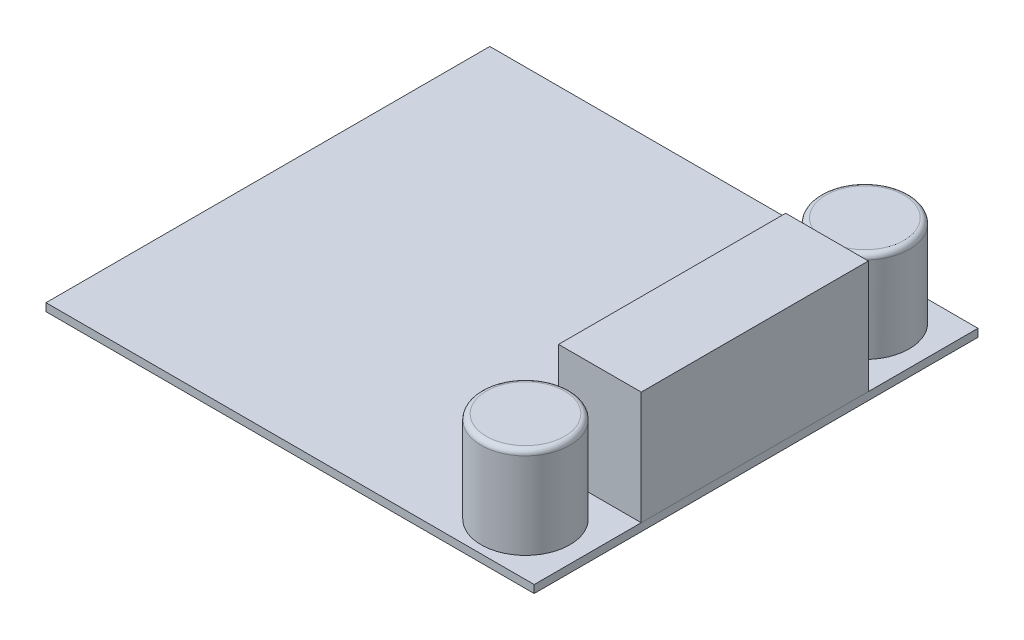
ISO-10303-21;
HEADER;
FILE_DESCRIPTION(('STEP AP214'),'2;1');
FILE_NAME('part.step','',(''),(''),'','','');
FILE_SCHEMA(('AUTOMOTIVE_DESIGN { 1 0 10303 214 1 1 1 1 }'));
ENDSEC;
DATA;
#1=APPLICATION_CONTEXT('core data for automotive mechanical design processes');
#2=APPLICATION_PROTOCOL_DEFINITION('international standard','automotive_design',2000,#1);
#3=PRODUCT_CONTEXT('',#1,'mechanical');
#4=PRODUCT('Part','Part','',(#3));
#5=PRODUCT_RELATED_PRODUCT_CATEGORY('part','',(#4));
#6=PRODUCT_DEFINITION_FORMATION('','',#4);
#7=PRODUCT_DEFINITION_CONTEXT('part definition',#1,'design');
#8=PRODUCT_DEFINITION('design','',#6,#7);
#9=PRODUCT_DEFINITION_SHAPE('','',#8);
#10=(LENGTH_UNIT() NAMED_UNIT(*) SI_UNIT(.MILLI.,.METRE.));
#11=(NAMED_UNIT(*) PLANE_ANGLE_UNIT() SI_UNIT($,.RADIAN.));
#12=(NAMED_UNIT(*) SI_UNIT($,.STERADIAN.) SOLID_ANGLE_UNIT());
#13=UNCERTAINTY_MEASURE_WITH_UNIT(LENGTH_MEASURE(1.E-05),#10,'distance_accuracy_value','');
#14=(GEOMETRIC_REPRESENTATION_CONTEXT(3) GLOBAL_UNCERTAINTY_ASSIGNED_CONTEXT((#13)) GLOBAL_UNIT_ASSIGNED_CONTEXT((#10,
#11,#12)) REPRESENTATION_CONTEXT('',''));
#15=CARTESIAN_POINT('',(0.,0.,0.));
#16=DIRECTION('',(0.,0.,1.));
#17=DIRECTION('',(1.,0.,0.));
#18=AXIS2_PLACEMENT_3D('',#15,#16,#17);
#19=CARTESIAN_POINT('',(18.55,13.9,-12.9));
#20=DIRECTION('',(1.,0.,0.));
#21=DIRECTION('',(0.,0.,-1.));
#22=AXIS2_PLACEMENT_3D('',#19,#20,#21);
#23=PLANE('',#22);
#24=DIRECTION('',(0.,0.,1.));
#25=VECTOR('',#24,1.);
#26=CARTESIAN_POINT('',(18.55,0.9,-12.9));
#27=LINE('',#26,#25);
#28=CARTESIAN_POINT('',(18.55,0.9,-12.9));
#29=VERTEX_POINT('',#28);
#30=CARTESIAN_POINT('',(18.55,0.9,13.2));
#31=VERTEX_POINT('',#30);
#32=EDGE_CURVE('E105',#29,#31,#27,.T.);
#33=ORIENTED_EDGE('',*,*,#32,.T.);
#34=DIRECTION('',(0.,-1.,0.));
#35=VECTOR('',#34,1.);
#36=CARTESIAN_POINT('',(18.55,13.9,13.2));
#37=LINE('',#36,#35);
#38=CARTESIAN_POINT('',(18.55,13.9,13.2));
#39=VERTEX_POINT('',#38);
#40=EDGE_CURVE('E12',#39,#31,#37,.T.);
#41=ORIENTED_EDGE('',*,*,#40,.F.);
#42=DIRECTION('',(0.,0.,1.));
#43=VECTOR('',#42,1.);
#44=CARTESIAN_POINT('',(18.55,13.9,-12.9));
#45=LINE('',#44,#43);
#46=CARTESIAN_POINT('',(18.55,13.9,-12.9));
#47=VERTEX_POINT('',#46);
#48=EDGE_CURVE('E93',#47,#39,#45,.T.);
#49=ORIENTED_EDGE('',*,*,#48,.F.);
#50=DIRECTION('',(0.,-1.,0.));
#51=VECTOR('',#50,1.);
#52=CARTESIAN_POINT('',(18.55,13.9,-12.9));
#53=LINE('',#52,#51);
#54=EDGE_CURVE('E101',#47,#29,#53,.T.);
#55=ORIENTED_EDGE('',*,*,#54,.T.);
#56=EDGE_LOOP('',(#33,#41,#49,#55));
#57=FACE_BOUND('',#56,.T.);
#58=ADVANCED_FACE('F42',(#57),#23,.F.);
#59=CARTESIAN_POINT('',(18.55,13.9,13.2));
#60=DIRECTION('',(0.,0.,-1.));
#61=DIRECTION('',(-1.,0.,0.));
#62=AXIS2_PLACEMENT_3D('',#59,#60,#61);
#63=PLANE('',#62);
#64=DIRECTION('',(1.,0.,0.));
#65=VECTOR('',#64,1.);
#66=CARTESIAN_POINT('',(18.55,0.9,13.2));
#67=LINE('',#66,#65);
#68=CARTESIAN_POINT('',(28.05,0.9,13.2));
#69=VERTEX_POINT('',#68);
#70=EDGE_CURVE('E97',#31,#69,#67,.T.);
#71=ORIENTED_EDGE('',*,*,#70,.T.);
#72=DIRECTION('',(0.,-1.,0.));
#73=VECTOR('',#72,1.);
#74=CARTESIAN_POINT('',(28.05,13.9,13.2));
#75=LINE('',#74,#73);
#76=CARTESIAN_POINT('',(28.05,13.9,13.2));
#77=VERTEX_POINT('',#76);
#78=EDGE_CURVE('E50',#77,#69,#75,.T.);
#79=ORIENTED_EDGE('',*,*,#78,.F.);
#80=DIRECTION('',(1.,0.,0.));
#81=VECTOR('',#80,1.);
#82=CARTESIAN_POINT('',(18.55,13.9,13.2));
#83=LINE('',#82,#81);
#84=EDGE_CURVE('E88',#39,#77,#83,.T.);
#85=ORIENTED_EDGE('',*,*,#84,.F.);
#86=ORIENTED_EDGE('',*,*,#40,.T.);
#87=EDGE_LOOP('',(#71,#79,#85,#86));
#88=FACE_BOUND('',#87,.T.);
#89=ADVANCED_FACE('F96',(#88),#63,.F.);
#90=CARTESIAN_POINT('',(28.05,13.9,-12.9));
#91=DIRECTION('',(-1.,0.,0.));
#92=DIRECTION('',(0.,0.,1.));
#93=AXIS2_PLACEMENT_3D('',#90,#91,#92);
#94=PLANE('',#93);
#95=DIRECTION('',(0.,0.,-1.));
#96=VECTOR('',#95,1.);
#97=CARTESIAN_POINT('',(28.05,0.9,-12.9));
#98=LINE('',#97,#96);
#99=CARTESIAN_POINT('',(28.05,0.9,-12.9));
#100=VERTEX_POINT('',#99);
#101=EDGE_CURVE('E75',#69,#100,#98,.T.);
#102=ORIENTED_EDGE('',*,*,#101,.T.);
#103=DIRECTION('',(0.,-1.,0.));
#104=VECTOR('',#103,1.);
#105=CARTESIAN_POINT('',(28.05,13.9,-12.9));
#106=LINE('',#105,#104);
#107=CARTESIAN_POINT('',(28.05,13.9,-12.9));
#108=VERTEX_POINT('',#107);
#109=EDGE_CURVE('E98',#108,#100,#106,.T.);
#110=ORIENTED_EDGE('',*,*,#109,.F.);
#111=DIRECTION('',(0.,0.,-1.));
#112=VECTOR('',#111,1.);
#113=CARTESIAN_POINT('',(28.05,13.9,-12.9));
#114=LINE('',#113,#112);
#115=EDGE_CURVE('E91',#77,#108,#114,.T.);
#116=ORIENTED_EDGE('',*,*,#115,.F.);
#117=ORIENTED_EDGE('',*,*,#78,.T.);
#118=EDGE_LOOP('',(#102,#110,#116,#117));
#119=FACE_BOUND('',#118,.T.);
#120=ADVANCED_FACE('F99',(#119),#94,.F.);
#121=CARTESIAN_POINT('',(18.55,13.9,-12.9));
#122=DIRECTION('',(0.,0.,1.));
#123=DIRECTION('',(1.,0.,0.));
#124=AXIS2_PLACEMENT_3D('',#121,#122,#123);
#125=PLANE('',#124);
#126=DIRECTION('',(-1.,0.,0.));
#127=VECTOR('',#126,1.);
#128=CARTESIAN_POINT('',(18.55,0.9,-12.9));
#129=LINE('',#128,#127);
#130=EDGE_CURVE('E81',#100,#29,#129,.T.);
#131=ORIENTED_EDGE('',*,*,#130,.T.);
#132=ORIENTED_EDGE('',*,*,#54,.F.);
#133=DIRECTION('',(-1.,0.,0.));
#134=VECTOR('',#133,1.);
#135=CARTESIAN_POINT('',(18.55,13.9,-12.9));
#136=LINE('',#135,#134);
#137=EDGE_CURVE('E58',#108,#47,#136,.T.);
#138=ORIENTED_EDGE('',*,*,#137,.F.);
#139=ORIENTED_EDGE('',*,*,#109,.T.);
#140=EDGE_LOOP('',(#131,#132,#138,#139));
#141=FACE_BOUND('',#140,.T.);
#142=ADVANCED_FACE('F112',(#141),#125,.F.);
#143=CARTESIAN_POINT('',(0.,13.9,0.));
#144=DIRECTION('',(0.,1.,0.));
#145=DIRECTION('',(0.,0.,1.));
#146=AXIS2_PLACEMENT_3D('',#143,#144,#145);
#147=PLANE('',#146);
#148=ORIENTED_EDGE('',*,*,#48,.T.);
#149=ORIENTED_EDGE('',*,*,#84,.T.);
#150=ORIENTED_EDGE('',*,*,#115,.T.);
#151=ORIENTED_EDGE('',*,*,#137,.T.);
#152=EDGE_LOOP('',(#148,#149,#150,#151));
#153=FACE_BOUND('',#152,.T.);
#154=ADVANCED_FACE('F89',(#153),#147,.T.);
#155=CARTESIAN_POINT('',(0.,0.9,0.));
#156=DIRECTION('',(0.,1.,0.));
#157=DIRECTION('',(0.,0.,1.));
#158=AXIS2_PLACEMENT_3D('',#155,#156,#157);
#159=PLANE('',#158);
#160=ORIENTED_EDGE('',*,*,#32,.F.);
#161=ORIENTED_EDGE('',*,*,#130,.F.);
#162=ORIENTED_EDGE('',*,*,#101,.F.);
#163=ORIENTED_EDGE('',*,*,#70,.F.);
#164=EDGE_LOOP('',(#160,#161,#162,#163));
#165=FACE_BOUND('',#164,.T.);
#166=ADVANCED_FACE('F115',(#165),#159,.F.);
#167=CLOSED_SHELL('',(#58,#89,#120,#142,#154,#166));
#168=MANIFOLD_SOLID_BREP('B2',#167);
#169=CARTESIAN_POINT('',(0.,0.9,0.));
#170=DIRECTION('',(0.,-1.,0.));
#171=DIRECTION('',(0.,0.,-1.));
#172=AXIS2_PLACEMENT_3D('',#169,#170,#171);
#173=PLANE('',#172);
#174=DIRECTION('',(0.,0.,-1.));
#175=VECTOR('',#174,1.);
#176=CARTESIAN_POINT('',(28.05,0.9,25.5));
#177=LINE('',#176,#175);
#178=CARTESIAN_POINT('',(28.05,0.9,25.5));
#179=VERTEX_POINT('',#178);
#180=CARTESIAN_POINT('',(28.05,0.9,-25.5));
#181=VERTEX_POINT('',#180);
#182=EDGE_CURVE('E218',#179,#181,#177,.T.);
#183=ORIENTED_EDGE('',*,*,#182,.T.);
#184=DIRECTION('',(-1.,0.,0.));
#185=VECTOR('',#184,1.);
#186=CARTESIAN_POINT('',(-28.05,0.9,-25.5));
#187=LINE('',#186,#185);
#188=CARTESIAN_POINT('',(-28.05,0.9,-25.5));
#189=VERTEX_POINT('',#188);
#190=EDGE_CURVE('E213',#181,#189,#187,.T.);
#191=ORIENTED_EDGE('',*,*,#190,.T.);
#192=DIRECTION('',(0.,0.,1.));
#193=VECTOR('',#192,1.);
#194=CARTESIAN_POINT('',(-28.05,0.9,25.5));
#195=LINE('',#194,#193);
#196=CARTESIAN_POINT('',(-28.05,0.9,25.5));
#197=VERTEX_POINT('',#196);
#198=EDGE_CURVE('E216',#189,#197,#195,.T.);
#199=ORIENTED_EDGE('',*,*,#198,.T.);
#200=DIRECTION('',(1.,0.,0.));
#201=VECTOR('',#200,1.);
#202=CARTESIAN_POINT('',(-28.05,0.9,25.5));
#203=LINE('',#202,#201);
#204=EDGE_CURVE('E182',#197,#179,#203,.T.);
#205=ORIENTED_EDGE('',*,*,#204,.T.);
#206=EDGE_LOOP('',(#183,#191,#199,#205));
#207=FACE_BOUND('',#206,.T.);
#208=CARTESIAN_POINT('',(21.05,0.9,-19.5));
#209=DIRECTION('',(0.,-1.,0.));
#210=DIRECTION('',(0.,0.,-1.));
#211=AXIS2_PLACEMENT_3D('',#208,#209,#210);
#212=CIRCLE('',#211,5.1);
#213=CARTESIAN_POINT('',(21.05,0.9,-24.6));
#214=VERTEX_POINT('',#213);
#215=EDGE_CURVE('E242',#214,#214,#212,.F.);
#216=ORIENTED_EDGE('',*,*,#215,.F.);
#217=EDGE_LOOP('',(#216));
#218=FACE_BOUND('',#217,.T.);
#219=CARTESIAN_POINT('',(21.05,0.9,19.5));
#220=DIRECTION('',(0.,-1.,0.));
#221=DIRECTION('',(0.,0.,-1.));
#222=AXIS2_PLACEMENT_3D('',#219,#220,#221);
#223=CIRCLE('',#222,5.1);
#224=CARTESIAN_POINT('',(21.05,0.9,14.4));
#225=VERTEX_POINT('',#224);
#226=EDGE_CURVE('E245',#225,#225,#223,.F.);
#227=ORIENTED_EDGE('',*,*,#226,.F.);
#228=EDGE_LOOP('',(#227));
#229=FACE_BOUND('',#228,.T.);
#230=ADVANCED_FACE('F165',(#207,#218,#229),#173,.F.);
#231=CARTESIAN_POINT('',(28.05,0.9,25.5));
#232=DIRECTION('',(-1.,0.,0.));
#233=DIRECTION('',(0.,0.,1.));
#234=AXIS2_PLACEMENT_3D('',#231,#232,#233);
#235=PLANE('',#234);
#236=DIRECTION('',(0.,0.,-1.));
#237=VECTOR('',#236,1.);
#238=CARTESIAN_POINT('',(28.05,0.,25.5));
#239=LINE('',#238,#237);
#240=CARTESIAN_POINT('',(28.05,0.,25.5));
#241=VERTEX_POINT('',#240);
#242=CARTESIAN_POINT('',(28.05,0.,-25.5));
#243=VERTEX_POINT('',#242);
#244=EDGE_CURVE('E233',#241,#243,#239,.T.);
#245=ORIENTED_EDGE('',*,*,#244,.T.);
#246=DIRECTION('',(0.,-1.,0.));
#247=VECTOR('',#246,1.);
#248=CARTESIAN_POINT('',(28.05,0.9,-25.5));
#249=LINE('',#248,#247);
#250=EDGE_CURVE('E224',#181,#243,#249,.T.);
#251=ORIENTED_EDGE('',*,*,#250,.F.);
#252=ORIENTED_EDGE('',*,*,#182,.F.);
#253=DIRECTION('',(0.,-1.,0.));
#254=VECTOR('',#253,1.);
#255=CARTESIAN_POINT('',(28.05,0.9,25.5));
#256=LINE('',#255,#254);
#257=EDGE_CURVE('E229',#179,#241,#256,.T.);
#258=ORIENTED_EDGE('',*,*,#257,.T.);
#259=EDGE_LOOP('',(#245,#251,#252,#258));
#260=FACE_BOUND('',#259,.T.);
#261=ADVANCED_FACE('F267',(#260),#235,.F.);
#262=CARTESIAN_POINT('',(-28.05,0.9,-25.5));
#263=DIRECTION('',(0.,0.,1.));
#264=DIRECTION('',(1.,0.,0.));
#265=AXIS2_PLACEMENT_3D('',#262,#263,#264);
#266=PLANE('',#265);
#267=DIRECTION('',(-1.,0.,0.));
#268=VECTOR('',#267,1.);
#269=CARTESIAN_POINT('',(-28.05,0.,-25.5));
#270=LINE('',#269,#268);
#271=CARTESIAN_POINT('',(-28.05,0.,-25.5));
#272=VERTEX_POINT('',#271);
#273=EDGE_CURVE('E223',#243,#272,#270,.T.);
#274=ORIENTED_EDGE('',*,*,#273,.T.);
#275=DIRECTION('',(0.,-1.,0.));
#276=VECTOR('',#275,1.);
#277=CARTESIAN_POINT('',(-28.05,0.9,-25.5));
#278=LINE('',#277,#276);
#279=EDGE_CURVE('E221',#189,#272,#278,.T.);
#280=ORIENTED_EDGE('',*,*,#279,.F.);
#281=ORIENTED_EDGE('',*,*,#190,.F.);
#282=ORIENTED_EDGE('',*,*,#250,.T.);
#283=EDGE_LOOP('',(#274,#280,#281,#282));
#284=FACE_BOUND('',#283,.T.);
#285=ADVANCED_FACE('F222',(#284),#266,.F.);
#286=CARTESIAN_POINT('',(-28.05,0.9,25.5));
#287=DIRECTION('',(1.,0.,0.));
#288=DIRECTION('',(0.,0.,-1.));
#289=AXIS2_PLACEMENT_3D('',#286,#287,#288);
#290=PLANE('',#289);
#291=DIRECTION('',(0.,0.,1.));
#292=VECTOR('',#291,1.);
#293=CARTESIAN_POINT('',(-28.05,0.,25.5));
#294=LINE('',#293,#292);
#295=CARTESIAN_POINT('',(-28.05,0.,25.5));
#296=VERTEX_POINT('',#295);
#297=EDGE_CURVE('E199',#272,#296,#294,.T.);
#298=ORIENTED_EDGE('',*,*,#297,.T.);
#299=DIRECTION('',(0.,-1.,0.));
#300=VECTOR('',#299,1.);
#301=CARTESIAN_POINT('',(-28.05,0.9,25.5));
#302=LINE('',#301,#300);
#303=EDGE_CURVE('E225',#197,#296,#302,.T.);
#304=ORIENTED_EDGE('',*,*,#303,.F.);
#305=ORIENTED_EDGE('',*,*,#198,.F.);
#306=ORIENTED_EDGE('',*,*,#279,.T.);
#307=EDGE_LOOP('',(#298,#304,#305,#306));
#308=FACE_BOUND('',#307,.T.);
#309=ADVANCED_FACE('F227',(#308),#290,.F.);
#310=CARTESIAN_POINT('',(-28.05,0.9,25.5));
#311=DIRECTION('',(0.,0.,-1.));
#312=DIRECTION('',(-1.,0.,0.));
#313=AXIS2_PLACEMENT_3D('',#310,#311,#312);
#314=PLANE('',#313);
#315=DIRECTION('',(1.,0.,0.));
#316=VECTOR('',#315,1.);
#317=CARTESIAN_POINT('',(-28.05,0.,25.5));
#318=LINE('',#317,#316);
#319=EDGE_CURVE('E205',#296,#241,#318,.T.);
#320=ORIENTED_EDGE('',*,*,#319,.T.);
#321=ORIENTED_EDGE('',*,*,#257,.F.);
#322=ORIENTED_EDGE('',*,*,#204,.F.);
#323=ORIENTED_EDGE('',*,*,#303,.T.);
#324=EDGE_LOOP('',(#320,#321,#322,#323));
#325=FACE_BOUND('',#324,.T.);
#326=ADVANCED_FACE('F281',(#325),#314,.F.);
#327=CARTESIAN_POINT('',(0.,0.,0.));
#328=DIRECTION('',(0.,-1.,0.));
#329=DIRECTION('',(0.,0.,-1.));
#330=AXIS2_PLACEMENT_3D('',#327,#328,#329);
#331=PLANE('',#330);
#332=ORIENTED_EDGE('',*,*,#244,.F.);
#333=ORIENTED_EDGE('',*,*,#319,.F.);
#334=ORIENTED_EDGE('',*,*,#297,.F.);
#335=ORIENTED_EDGE('',*,*,#273,.F.);
#336=EDGE_LOOP('',(#332,#333,#334,#335));
#337=FACE_BOUND('',#336,.T.);
#338=ADVANCED_FACE('F278',(#337),#331,.T.);
#339=CARTESIAN_POINT('',(21.05,11.4,-19.5));
#340=DIRECTION('',(0.,-1.,0.));
#341=DIRECTION('',(0.,0.,-1.));
#342=AXIS2_PLACEMENT_3D('',#339,#340,#341);
#343=CYLINDRICAL_SURFACE('',#342,5.1);
#344=CARTESIAN_POINT('',(21.05,10.8,-19.5));
#345=DIRECTION('',(0.,1.,0.));
#346=DIRECTION('',(0.,0.,1.));
#347=AXIS2_PLACEMENT_3D('',#344,#345,#346);
#348=CIRCLE('',#347,5.1);
#349=CARTESIAN_POINT('',(21.05,10.8,-14.4));
#350=VERTEX_POINT('',#349);
#351=EDGE_CURVE('E251',#350,#350,#348,.F.);
#352=ORIENTED_EDGE('',*,*,#351,.T.);
#353=EDGE_LOOP('',(#352));
#354=FACE_BOUND('',#353,.T.);
#355=ORIENTED_EDGE('',*,*,#215,.T.);
#356=EDGE_LOOP('',(#355));
#357=FACE_BOUND('',#356,.T.);
#358=ADVANCED_FACE('F276',(#354,#357),#343,.T.);
#359=CARTESIAN_POINT('',(21.05,11.4,-19.5));
#360=DIRECTION('',(0.,1.,0.));
#361=DIRECTION('',(0.,0.,1.));
#362=AXIS2_PLACEMENT_3D('',#359,#360,#361);
#363=PLANE('',#362);
#364=CARTESIAN_POINT('',(21.05,11.4,-19.5));
#365=DIRECTION('',(0.,1.,0.));
#366=DIRECTION('',(0.,0.,1.));
#367=AXIS2_PLACEMENT_3D('',#364,#365,#366);
#368=CIRCLE('',#367,4.5);
#369=CARTESIAN_POINT('',(21.05,11.4,-15.));
#370=VERTEX_POINT('',#369);
#371=EDGE_CURVE('E248',#370,#370,#368,.T.);
#372=ORIENTED_EDGE('',*,*,#371,.T.);
#373=EDGE_LOOP('',(#372));
#374=FACE_BOUND('',#373,.T.);
#375=ADVANCED_FACE('F310',(#374),#363,.T.);
#376=CARTESIAN_POINT('',(21.05,11.4,19.5));
#377=DIRECTION('',(0.,-1.,0.));
#378=DIRECTION('',(0.,0.,-1.));
#379=AXIS2_PLACEMENT_3D('',#376,#377,#378);
#380=CYLINDRICAL_SURFACE('',#379,5.1);
#381=CARTESIAN_POINT('',(21.05,10.8,19.5));
#382=DIRECTION('',(0.,-1.,0.));
#383=DIRECTION('',(0.,0.,-1.));
#384=AXIS2_PLACEMENT_3D('',#381,#382,#383);
#385=CIRCLE('',#384,5.1);
#386=CARTESIAN_POINT('',(21.05,10.8,14.4));
#387=VERTEX_POINT('',#386);
#388=EDGE_CURVE('E40',#387,#387,#385,.T.);
#389=ORIENTED_EDGE('',*,*,#388,.T.);
#390=EDGE_LOOP('',(#389));
#391=FACE_BOUND('',#390,.T.);
#392=ORIENTED_EDGE('',*,*,#226,.T.);
#393=EDGE_LOOP('',(#392));
#394=FACE_BOUND('',#393,.T.);
#395=ADVANCED_FACE('F317',(#391,#394),#380,.T.);
#396=CARTESIAN_POINT('',(21.05,11.4,19.5));
#397=DIRECTION('',(0.,-1.,0.));
#398=DIRECTION('',(0.,0.,-1.));
#399=AXIS2_PLACEMENT_3D('',#396,#397,#398);
#400=PLANE('',#399);
#401=CARTESIAN_POINT('',(21.05,11.4,19.5));
#402=DIRECTION('',(0.,-1.,0.));
#403=DIRECTION('',(0.,0.,-1.));
#404=AXIS2_PLACEMENT_3D('',#401,#402,#403);
#405=CIRCLE('',#404,4.5);
#406=CARTESIAN_POINT('',(21.05,11.4,15.));
#407=VERTEX_POINT('',#406);
#408=EDGE_CURVE('E174',#407,#407,#405,.F.);
#409=ORIENTED_EDGE('',*,*,#408,.T.);
#410=EDGE_LOOP('',(#409));
#411=FACE_BOUND('',#410,.T.);
#412=ADVANCED_FACE('F256',(#411),#400,.F.);
#413=CARTESIAN_POINT('',(21.05,10.8,-19.5));
#414=DIRECTION('',(0.,1.,0.));
#415=DIRECTION('',(0.,0.,1.));
#416=AXIS2_PLACEMENT_3D('',#413,#414,#415);
#417=TOROIDAL_SURFACE('',#416,4.5,0.6);
#418=ORIENTED_EDGE('',*,*,#351,.F.);
#419=EDGE_LOOP('',(#418));
#420=FACE_BOUND('',#419,.T.);
#421=ORIENTED_EDGE('',*,*,#371,.F.);
#422=EDGE_LOOP('',(#421));
#423=FACE_BOUND('',#422,.T.);
#424=ADVANCED_FACE('F259',(#420,#423),#417,.T.);
#425=CARTESIAN_POINT('',(21.05,10.8,19.5));
#426=DIRECTION('',(0.,-1.,0.));
#427=DIRECTION('',(0.,0.,-1.));
#428=AXIS2_PLACEMENT_3D('',#425,#426,#427);
#429=TOROIDAL_SURFACE('',#428,4.5,0.6);
#430=ORIENTED_EDGE('',*,*,#388,.F.);
#431=EDGE_LOOP('',(#430));
#432=FACE_BOUND('',#431,.T.);
#433=ORIENTED_EDGE('',*,*,#408,.F.);
#434=EDGE_LOOP('',(#433));
#435=FACE_BOUND('',#434,.T.);
#436=ADVANCED_FACE('F167',(#432,#435),#429,.T.);
#437=CLOSED_SHELL('',(#230,#261,#285,#309,#326,#338,#358,#375,#395,#412,#424,#436));
#438=MANIFOLD_SOLID_BREP('B6',#437);
#439=ADVANCED_BREP_SHAPE_REPRESENTATION('',(#18,#168,#438),#14);
#440=SHAPE_DEFINITION_REPRESENTATION(#9,#439);
ENDSEC;
END-ISO-10303-21;
